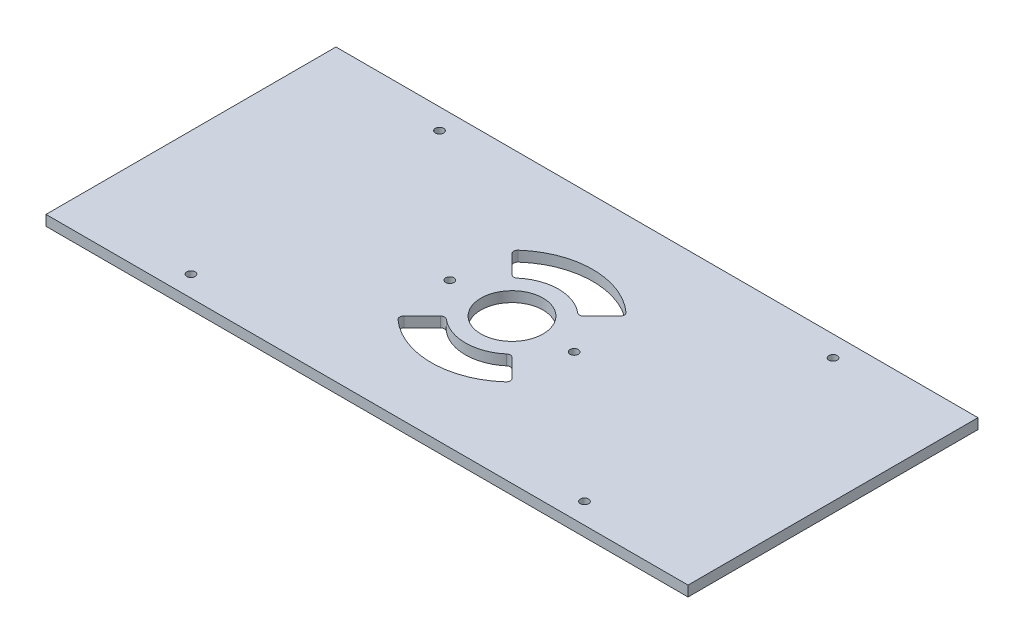
ISO-10303-21;
HEADER;
FILE_DESCRIPTION(('STEP AP214'),'2;1');
FILE_NAME('part.step','',(''),(''),'','','');
FILE_SCHEMA(('AUTOMOTIVE_DESIGN { 1 0 10303 214 1 1 1 1 }'));
ENDSEC;
DATA;
#1=APPLICATION_CONTEXT('core data for automotive mechanical design processes');
#2=APPLICATION_PROTOCOL_DEFINITION('international standard','automotive_design',2000,#1);
#3=PRODUCT_CONTEXT('',#1,'mechanical');
#4=PRODUCT('Part','Part','',(#3));
#5=PRODUCT_RELATED_PRODUCT_CATEGORY('part','',(#4));
#6=PRODUCT_DEFINITION_FORMATION('','',#4);
#7=PRODUCT_DEFINITION_CONTEXT('part definition',#1,'design');
#8=PRODUCT_DEFINITION('design','',#6,#7);
#9=PRODUCT_DEFINITION_SHAPE('','',#8);
#10=(LENGTH_UNIT() NAMED_UNIT(*) SI_UNIT(.MILLI.,.METRE.));
#11=(NAMED_UNIT(*) PLANE_ANGLE_UNIT() SI_UNIT($,.RADIAN.));
#12=(NAMED_UNIT(*) SI_UNIT($,.STERADIAN.) SOLID_ANGLE_UNIT());
#13=UNCERTAINTY_MEASURE_WITH_UNIT(LENGTH_MEASURE(1.E-05),#10,'distance_accuracy_value','');
#14=(GEOMETRIC_REPRESENTATION_CONTEXT(3) GLOBAL_UNCERTAINTY_ASSIGNED_CONTEXT((#13)) GLOBAL_UNIT_ASSIGNED_CONTEXT((#10,
#11,#12)) REPRESENTATION_CONTEXT('',''));
#15=CARTESIAN_POINT('',(0.,0.,0.));
#16=DIRECTION('',(0.,0.,1.));
#17=DIRECTION('',(1.,0.,0.));
#18=AXIS2_PLACEMENT_3D('',#15,#16,#17);
#19=CARTESIAN_POINT('',(0.,5.,0.));
#20=DIRECTION('',(0.,1.,0.));
#21=DIRECTION('',(0.,0.,1.));
#22=AXIS2_PLACEMENT_3D('',#19,#20,#21);
#23=PLANE('',#22);
#24=CARTESIAN_POINT('',(-30.,5.,0.));
#25=DIRECTION('',(0.,1.,0.));
#26=DIRECTION('',(0.,0.,1.));
#27=AXIS2_PLACEMENT_3D('',#24,#25,#26);
#28=CIRCLE('',#27,2.);
#29=CARTESIAN_POINT('',(-30.,5.,2.));
#30=VERTEX_POINT('',#29);
#31=EDGE_CURVE('E545',#30,#30,#28,.T.);
#32=ORIENTED_EDGE('',*,*,#31,.F.);
#33=EDGE_LOOP('',(#32));
#34=FACE_BOUND('',#33,.T.);
#35=CARTESIAN_POINT('',(30.,5.,0.));
#36=DIRECTION('',(0.,1.,0.));
#37=DIRECTION('',(0.,0.,1.));
#38=AXIS2_PLACEMENT_3D('',#35,#36,#37);
#39=CIRCLE('',#38,2.);
#40=CARTESIAN_POINT('',(30.,5.,1.99999999999999));
#41=VERTEX_POINT('',#40);
#42=EDGE_CURVE('E553',#41,#41,#39,.T.);
#43=ORIENTED_EDGE('',*,*,#42,.F.);
#44=EDGE_LOOP('',(#43));
#45=FACE_BOUND('',#44,.T.);
#46=CARTESIAN_POINT('',(-95.,5.,60.));
#47=DIRECTION('',(0.,1.,0.));
#48=DIRECTION('',(0.,0.,-1.));
#49=AXIS2_PLACEMENT_3D('',#46,#47,#48);
#50=CIRCLE('',#49,2.);
#51=CARTESIAN_POINT('',(-95.,5.,58.));
#52=VERTEX_POINT('',#51);
#53=EDGE_CURVE('E574',#52,#52,#50,.T.);
#54=ORIENTED_EDGE('',*,*,#53,.F.);
#55=EDGE_LOOP('',(#54));
#56=FACE_BOUND('',#55,.T.);
#57=CARTESIAN_POINT('',(95.,5.,60.));
#58=DIRECTION('',(0.,1.,0.));
#59=DIRECTION('',(0.,0.,1.));
#60=AXIS2_PLACEMENT_3D('',#57,#58,#59);
#61=CIRCLE('',#60,2.);
#62=CARTESIAN_POINT('',(95.,5.,62.));
#63=VERTEX_POINT('',#62);
#64=EDGE_CURVE('E801',#63,#63,#61,.T.);
#65=ORIENTED_EDGE('',*,*,#64,.F.);
#66=EDGE_LOOP('',(#65));
#67=FACE_BOUND('',#66,.T.);
#68=CARTESIAN_POINT('',(95.,5.,-60.));
#69=DIRECTION('',(0.,1.,0.));
#70=DIRECTION('',(0.,0.,-1.));
#71=AXIS2_PLACEMENT_3D('',#68,#69,#70);
#72=CIRCLE('',#71,2.);
#73=CARTESIAN_POINT('',(95.,5.,-62.));
#74=VERTEX_POINT('',#73);
#75=EDGE_CURVE('E407',#74,#74,#72,.T.);
#76=ORIENTED_EDGE('',*,*,#75,.F.);
#77=EDGE_LOOP('',(#76));
#78=FACE_BOUND('',#77,.T.);
#79=CARTESIAN_POINT('',(-95.,5.,-60.));
#80=DIRECTION('',(0.,1.,0.));
#81=DIRECTION('',(0.,0.,1.));
#82=AXIS2_PLACEMENT_3D('',#79,#80,#81);
#83=CIRCLE('',#82,2.);
#84=CARTESIAN_POINT('',(-95.,5.,-58.));
#85=VERTEX_POINT('',#84);
#86=EDGE_CURVE('E406',#85,#85,#83,.T.);
#87=ORIENTED_EDGE('',*,*,#86,.F.);
#88=EDGE_LOOP('',(#87));
#89=FACE_BOUND('',#88,.T.);
#90=CARTESIAN_POINT('',(0.,5.,0.));
#91=DIRECTION('',(0.,1.,0.));
#92=DIRECTION('',(0.,0.,1.));
#93=AXIS2_PLACEMENT_3D('',#90,#91,#92);
#94=CIRCLE('',#93,15.);
#95=CARTESIAN_POINT('',(0.,5.,15.));
#96=VERTEX_POINT('',#95);
#97=EDGE_CURVE('E432',#96,#96,#94,.T.);
#98=ORIENTED_EDGE('',*,*,#97,.F.);
#99=EDGE_LOOP('',(#98));
#100=FACE_BOUND('',#99,.T.);
#101=DIRECTION('',(0.,0.,-1.));
#102=VECTOR('',#101,1.);
#103=CARTESIAN_POINT('',(155.,5.,-70.));
#104=LINE('',#103,#102);
#105=CARTESIAN_POINT('',(155.,5.,70.));
#106=VERTEX_POINT('',#105);
#107=CARTESIAN_POINT('',(155.,5.,-70.));
#108=VERTEX_POINT('',#107);
#109=EDGE_CURVE('E192',#106,#108,#104,.T.);
#110=ORIENTED_EDGE('',*,*,#109,.T.);
#111=DIRECTION('',(-1.,0.,0.));
#112=VECTOR('',#111,1.);
#113=CARTESIAN_POINT('',(-155.,5.,-70.));
#114=LINE('',#113,#112);
#115=CARTESIAN_POINT('',(-155.,5.,-70.));
#116=VERTEX_POINT('',#115);
#117=EDGE_CURVE('E180',#108,#116,#114,.T.);
#118=ORIENTED_EDGE('',*,*,#117,.T.);
#119=DIRECTION('',(0.,0.,1.));
#120=VECTOR('',#119,1.);
#121=CARTESIAN_POINT('',(-155.,5.,-70.));
#122=LINE('',#121,#120);
#123=CARTESIAN_POINT('',(-155.,5.,70.));
#124=VERTEX_POINT('',#123);
#125=EDGE_CURVE('E191',#116,#124,#122,.T.);
#126=ORIENTED_EDGE('',*,*,#125,.T.);
#127=DIRECTION('',(1.,0.,0.));
#128=VECTOR('',#127,1.);
#129=CARTESIAN_POINT('',(-155.,5.,70.));
#130=LINE('',#129,#128);
#131=EDGE_CURVE('E197',#124,#106,#130,.T.);
#132=ORIENTED_EDGE('',*,*,#131,.T.);
#133=EDGE_LOOP('',(#110,#118,#126,#132));
#134=FACE_BOUND('',#133,.T.);
#135=DIRECTION('',(0.707106781186546,0.,-0.707106781186549));
#136=VECTOR('',#135,1.);
#137=CARTESIAN_POINT('',(0.,5.,0.));
#138=LINE('',#137,#136);
#139=CARTESIAN_POINT('',(17.266296649832,5.,-17.266296649832));
#140=VERTEX_POINT('',#139);
#141=CARTESIAN_POINT('',(26.1247009552262,5.,-26.1247009552263));
#142=VERTEX_POINT('',#141);
#143=EDGE_CURVE('E357',#140,#142,#138,.T.);
#144=ORIENTED_EDGE('',*,*,#143,.F.);
#145=CARTESIAN_POINT('',(15.8520830874589,5.,-18.6805102122051));
#146=DIRECTION('',(0.,1.,0.));
#147=DIRECTION('',(0.,0.,1.));
#148=AXIS2_PLACEMENT_3D('',#145,#146,#147);
#149=CIRCLE('',#148,2.);
#150=CARTESIAN_POINT('',(14.5580354884826,5.,-17.1555706030455));
#151=VERTEX_POINT('',#150);
#152=EDGE_CURVE('E336',#140,#151,#149,.F.);
#153=ORIENTED_EDGE('',*,*,#152,.T.);
#154=CARTESIAN_POINT('',(0.,5.,0.));
#155=DIRECTION('',(0.,1.,0.));
#156=DIRECTION('',(0.,0.,1.));
#157=AXIS2_PLACEMENT_3D('',#154,#155,#156);
#158=CIRCLE('',#157,22.5);
#159=CARTESIAN_POINT('',(-14.5580354884825,5.,-17.1555706030456));
#160=VERTEX_POINT('',#159);
#161=EDGE_CURVE('E375',#151,#160,#158,.T.);
#162=ORIENTED_EDGE('',*,*,#161,.T.);
#163=CARTESIAN_POINT('',(-15.8520830874588,5.,-18.6805102122052));
#164=DIRECTION('',(0.,1.,0.));
#165=DIRECTION('',(0.,0.,1.));
#166=AXIS2_PLACEMENT_3D('',#163,#164,#165);
#167=CIRCLE('',#166,2.);
#168=CARTESIAN_POINT('',(-17.2662966498319,5.,-17.2662966498322));
#169=VERTEX_POINT('',#168);
#170=EDGE_CURVE('E324',#160,#169,#167,.F.);
#171=ORIENTED_EDGE('',*,*,#170,.T.);
#172=DIRECTION('',(-0.707106781186542,0.,-0.707106781186553));
#173=VECTOR('',#172,1.);
#174=CARTESIAN_POINT('',(0.,5.,0.));
#175=LINE('',#174,#173);
#176=CARTESIAN_POINT('',(-26.1247009552261,5.,-26.1247009552265));
#177=VERTEX_POINT('',#176);
#178=EDGE_CURVE('E348',#169,#177,#175,.T.);
#179=ORIENTED_EDGE('',*,*,#178,.T.);
#180=CARTESIAN_POINT('',(-24.7104873928529,5.,-27.5389145175996));
#181=DIRECTION('',(0.,1.,0.));
#182=DIRECTION('',(0.,0.,1.));
#183=AXIS2_PLACEMENT_3D('',#180,#181,#182);
#184=CIRCLE('',#183,2.);
#185=CARTESIAN_POINT('',(-26.0461894140882,5.,-29.0275044915239));
#186=VERTEX_POINT('',#185);
#187=EDGE_CURVE('E50',#177,#186,#184,.F.);
#188=ORIENTED_EDGE('',*,*,#187,.T.);
#189=CARTESIAN_POINT('',(0.,5.,0.));
#190=DIRECTION('',(0.,1.,0.));
#191=DIRECTION('',(0.,0.,1.));
#192=AXIS2_PLACEMENT_3D('',#189,#190,#191);
#193=CIRCLE('',#192,39.);
#194=CARTESIAN_POINT('',(26.0461894140884,5.,-29.0275044915237));
#195=VERTEX_POINT('',#194);
#196=EDGE_CURVE('E346',#195,#186,#193,.T.);
#197=ORIENTED_EDGE('',*,*,#196,.F.);
#198=CARTESIAN_POINT('',(24.7104873928531,5.,-27.5389145175994));
#199=DIRECTION('',(0.,1.,0.));
#200=DIRECTION('',(0.,0.,1.));
#201=AXIS2_PLACEMENT_3D('',#198,#199,#200);
#202=CIRCLE('',#201,2.);
#203=EDGE_CURVE('E330',#195,#142,#202,.F.);
#204=ORIENTED_EDGE('',*,*,#203,.T.);
#205=EDGE_LOOP('',(#144,#153,#162,#171,#179,#188,#197,#204));
#206=FACE_BOUND('',#205,.T.);
#207=DIRECTION('',(-0.707106781186551,0.,0.707106781186544));
#208=VECTOR('',#207,1.);
#209=CARTESIAN_POINT('',(0.,5.,0.));
#210=LINE('',#209,#208);
#211=CARTESIAN_POINT('',(-17.2662966498321,5.,17.2662966498319));
#212=VERTEX_POINT('',#211);
#213=CARTESIAN_POINT('',(-26.1247009552264,5.,26.1247009552261));
#214=VERTEX_POINT('',#213);
#215=EDGE_CURVE('E567',#212,#214,#210,.T.);
#216=ORIENTED_EDGE('',*,*,#215,.F.);
#217=CARTESIAN_POINT('',(-15.852083087459,5.,18.680510212205));
#218=DIRECTION('',(0.,1.,0.));
#219=DIRECTION('',(0.,0.,1.));
#220=AXIS2_PLACEMENT_3D('',#217,#218,#219);
#221=CIRCLE('',#220,2.);
#222=CARTESIAN_POINT('',(-14.5580354884828,5.,17.1555706030454));
#223=VERTEX_POINT('',#222);
#224=EDGE_CURVE('E318',#212,#223,#221,.F.);
#225=ORIENTED_EDGE('',*,*,#224,.T.);
#226=CARTESIAN_POINT('',(0.,5.,0.));
#227=DIRECTION('',(0.,1.,0.));
#228=DIRECTION('',(0.,0.,1.));
#229=AXIS2_PLACEMENT_3D('',#226,#227,#228);
#230=CIRCLE('',#229,22.5);
#231=CARTESIAN_POINT('',(14.5580354884826,5.,17.1555706030455));
#232=VERTEX_POINT('',#231);
#233=EDGE_CURVE('E401',#223,#232,#230,.T.);
#234=ORIENTED_EDGE('',*,*,#233,.T.);
#235=CARTESIAN_POINT('',(15.8520830874589,5.,18.6805102122051));
#236=DIRECTION('',(0.,1.,0.));
#237=DIRECTION('',(0.,0.,1.));
#238=AXIS2_PLACEMENT_3D('',#235,#236,#237);
#239=CIRCLE('',#238,2.);
#240=CARTESIAN_POINT('',(17.266296649832,5.,17.266296649832));
#241=VERTEX_POINT('',#240);
#242=EDGE_CURVE('E300',#232,#241,#239,.F.);
#243=ORIENTED_EDGE('',*,*,#242,.T.);
#244=DIRECTION('',(0.707106781186546,0.,0.707106781186549));
#245=VECTOR('',#244,1.);
#246=CARTESIAN_POINT('',(0.,5.,0.));
#247=LINE('',#246,#245);
#248=CARTESIAN_POINT('',(26.1247009552262,5.,26.1247009552263));
#249=VERTEX_POINT('',#248);
#250=EDGE_CURVE('E570',#241,#249,#247,.T.);
#251=ORIENTED_EDGE('',*,*,#250,.T.);
#252=CARTESIAN_POINT('',(24.7104873928531,5.,27.5389145175994));
#253=DIRECTION('',(0.,1.,0.));
#254=DIRECTION('',(0.,0.,1.));
#255=AXIS2_PLACEMENT_3D('',#252,#253,#254);
#256=CIRCLE('',#255,2.);
#257=CARTESIAN_POINT('',(26.0461894140884,5.,29.0275044915237));
#258=VERTEX_POINT('',#257);
#259=EDGE_CURVE('E306',#249,#258,#256,.F.);
#260=ORIENTED_EDGE('',*,*,#259,.T.);
#261=CARTESIAN_POINT('',(0.,5.,0.));
#262=DIRECTION('',(0.,1.,0.));
#263=DIRECTION('',(0.,0.,1.));
#264=AXIS2_PLACEMENT_3D('',#261,#262,#263);
#265=CIRCLE('',#264,39.);
#266=CARTESIAN_POINT('',(-26.0461894140886,5.,29.0275044915235));
#267=VERTEX_POINT('',#266);
#268=EDGE_CURVE('E575',#267,#258,#265,.T.);
#269=ORIENTED_EDGE('',*,*,#268,.F.);
#270=CARTESIAN_POINT('',(-24.7104873928533,5.,27.5389145175992));
#271=DIRECTION('',(0.,1.,0.));
#272=DIRECTION('',(0.,0.,1.));
#273=AXIS2_PLACEMENT_3D('',#270,#271,#272);
#274=CIRCLE('',#273,2.);
#275=EDGE_CURVE('E312',#267,#214,#274,.F.);
#276=ORIENTED_EDGE('',*,*,#275,.T.);
#277=EDGE_LOOP('',(#216,#225,#234,#243,#251,#260,#269,#276));
#278=FACE_BOUND('',#277,.T.);
#279=ADVANCED_FACE('F41',(#34,#45,#56,#67,#78,#89,#100,#134,#206,#278),#23,.T.);
#280=CARTESIAN_POINT('',(0.,0.,0.));
#281=DIRECTION('',(0.,1.,0.));
#282=DIRECTION('',(0.,0.,1.));
#283=AXIS2_PLACEMENT_3D('',#280,#281,#282);
#284=PLANE('',#283);
#285=CARTESIAN_POINT('',(-30.,0.,0.));
#286=DIRECTION('',(0.,1.,0.));
#287=DIRECTION('',(0.,0.,1.));
#288=AXIS2_PLACEMENT_3D('',#285,#286,#287);
#289=CIRCLE('',#288,2.);
#290=CARTESIAN_POINT('',(-30.,0.,2.));
#291=VERTEX_POINT('',#290);
#292=EDGE_CURVE('E383',#291,#291,#289,.T.);
#293=ORIENTED_EDGE('',*,*,#292,.T.);
#294=EDGE_LOOP('',(#293));
#295=FACE_BOUND('',#294,.T.);
#296=CARTESIAN_POINT('',(30.,0.,0.));
#297=DIRECTION('',(0.,1.,0.));
#298=DIRECTION('',(0.,0.,1.));
#299=AXIS2_PLACEMENT_3D('',#296,#297,#298);
#300=CIRCLE('',#299,2.);
#301=CARTESIAN_POINT('',(30.,0.,1.99999999999999));
#302=VERTEX_POINT('',#301);
#303=EDGE_CURVE('E547',#302,#302,#300,.T.);
#304=ORIENTED_EDGE('',*,*,#303,.T.);
#305=EDGE_LOOP('',(#304));
#306=FACE_BOUND('',#305,.T.);
#307=CARTESIAN_POINT('',(0.,0.,0.));
#308=DIRECTION('',(0.,1.,0.));
#309=DIRECTION('',(0.,0.,1.));
#310=AXIS2_PLACEMENT_3D('',#307,#308,#309);
#311=CIRCLE('',#310,22.5);
#312=CARTESIAN_POINT('',(14.5580354884826,0.,-17.1555706030455));
#313=VERTEX_POINT('',#312);
#314=CARTESIAN_POINT('',(-14.5580354884825,0.,-17.1555706030456));
#315=VERTEX_POINT('',#314);
#316=EDGE_CURVE('E225',#313,#315,#311,.T.);
#317=ORIENTED_EDGE('',*,*,#316,.F.);
#318=CARTESIAN_POINT('',(15.8520830874589,0.,-18.6805102122051));
#319=DIRECTION('',(0.,1.,0.));
#320=DIRECTION('',(0.,0.,1.));
#321=AXIS2_PLACEMENT_3D('',#318,#319,#320);
#322=CIRCLE('',#321,2.);
#323=CARTESIAN_POINT('',(17.266296649832,0.,-17.266296649832));
#324=VERTEX_POINT('',#323);
#325=EDGE_CURVE('E64',#313,#324,#322,.T.);
#326=ORIENTED_EDGE('',*,*,#325,.T.);
#327=DIRECTION('',(0.707106781186546,0.,-0.707106781186549));
#328=VECTOR('',#327,1.);
#329=CARTESIAN_POINT('',(0.,0.,0.));
#330=LINE('',#329,#328);
#331=CARTESIAN_POINT('',(26.1247009552262,0.,-26.1247009552263));
#332=VERTEX_POINT('',#331);
#333=EDGE_CURVE('E208',#324,#332,#330,.T.);
#334=ORIENTED_EDGE('',*,*,#333,.T.);
#335=CARTESIAN_POINT('',(24.7104873928531,0.,-27.5389145175994));
#336=DIRECTION('',(0.,1.,0.));
#337=DIRECTION('',(0.,0.,1.));
#338=AXIS2_PLACEMENT_3D('',#335,#336,#337);
#339=CIRCLE('',#338,2.);
#340=CARTESIAN_POINT('',(26.0461894140884,0.,-29.0275044915237));
#341=VERTEX_POINT('',#340);
#342=EDGE_CURVE('E333',#332,#341,#339,.T.);
#343=ORIENTED_EDGE('',*,*,#342,.T.);
#344=CARTESIAN_POINT('',(0.,0.,0.));
#345=DIRECTION('',(0.,1.,0.));
#346=DIRECTION('',(0.,0.,1.));
#347=AXIS2_PLACEMENT_3D('',#344,#345,#346);
#348=CIRCLE('',#347,39.);
#349=CARTESIAN_POINT('',(-26.0461894140882,0.,-29.0275044915239));
#350=VERTEX_POINT('',#349);
#351=EDGE_CURVE('E212',#341,#350,#348,.T.);
#352=ORIENTED_EDGE('',*,*,#351,.T.);
#353=CARTESIAN_POINT('',(-24.7104873928529,0.,-27.5389145175996));
#354=DIRECTION('',(0.,1.,0.));
#355=DIRECTION('',(0.,0.,1.));
#356=AXIS2_PLACEMENT_3D('',#353,#354,#355);
#357=CIRCLE('',#356,2.);
#358=CARTESIAN_POINT('',(-26.1247009552261,0.,-26.1247009552265));
#359=VERTEX_POINT('',#358);
#360=EDGE_CURVE('E12',#350,#359,#357,.T.);
#361=ORIENTED_EDGE('',*,*,#360,.T.);
#362=DIRECTION('',(-0.707106781186542,0.,-0.707106781186553));
#363=VECTOR('',#362,1.);
#364=CARTESIAN_POINT('',(0.,0.,0.));
#365=LINE('',#364,#363);
#366=CARTESIAN_POINT('',(-17.2662966498319,0.,-17.2662966498322));
#367=VERTEX_POINT('',#366);
#368=EDGE_CURVE('E221',#367,#359,#365,.T.);
#369=ORIENTED_EDGE('',*,*,#368,.F.);
#370=CARTESIAN_POINT('',(-15.8520830874588,0.,-18.6805102122052));
#371=DIRECTION('',(0.,1.,0.));
#372=DIRECTION('',(0.,0.,1.));
#373=AXIS2_PLACEMENT_3D('',#370,#371,#372);
#374=CIRCLE('',#373,2.);
#375=EDGE_CURVE('E327',#367,#315,#374,.T.);
#376=ORIENTED_EDGE('',*,*,#375,.T.);
#377=EDGE_LOOP('',(#317,#326,#334,#343,#352,#361,#369,#376));
#378=FACE_BOUND('',#377,.T.);
#379=CARTESIAN_POINT('',(-95.,0.,60.));
#380=DIRECTION('',(0.,1.,0.));
#381=DIRECTION('',(0.,0.,-1.));
#382=AXIS2_PLACEMENT_3D('',#379,#380,#381);
#383=CIRCLE('',#382,2.);
#384=CARTESIAN_POINT('',(-95.,0.,58.));
#385=VERTEX_POINT('',#384);
#386=EDGE_CURVE('E798',#385,#385,#383,.T.);
#387=ORIENTED_EDGE('',*,*,#386,.T.);
#388=EDGE_LOOP('',(#387));
#389=FACE_BOUND('',#388,.T.);
#390=CARTESIAN_POINT('',(95.,0.,60.));
#391=DIRECTION('',(0.,1.,0.));
#392=DIRECTION('',(0.,0.,1.));
#393=AXIS2_PLACEMENT_3D('',#390,#391,#392);
#394=CIRCLE('',#393,2.);
#395=CARTESIAN_POINT('',(95.,0.,62.));
#396=VERTEX_POINT('',#395);
#397=EDGE_CURVE('E412',#396,#396,#394,.T.);
#398=ORIENTED_EDGE('',*,*,#397,.T.);
#399=EDGE_LOOP('',(#398));
#400=FACE_BOUND('',#399,.T.);
#401=CARTESIAN_POINT('',(95.,0.,-60.));
#402=DIRECTION('',(0.,1.,0.));
#403=DIRECTION('',(0.,0.,-1.));
#404=AXIS2_PLACEMENT_3D('',#401,#402,#403);
#405=CIRCLE('',#404,2.);
#406=CARTESIAN_POINT('',(95.,0.,-62.));
#407=VERTEX_POINT('',#406);
#408=EDGE_CURVE('E402',#407,#407,#405,.T.);
#409=ORIENTED_EDGE('',*,*,#408,.T.);
#410=EDGE_LOOP('',(#409));
#411=FACE_BOUND('',#410,.T.);
#412=CARTESIAN_POINT('',(-95.,0.,-60.));
#413=DIRECTION('',(0.,1.,0.));
#414=DIRECTION('',(0.,0.,1.));
#415=AXIS2_PLACEMENT_3D('',#412,#413,#414);
#416=CIRCLE('',#415,2.);
#417=CARTESIAN_POINT('',(-95.,0.,-58.));
#418=VERTEX_POINT('',#417);
#419=EDGE_CURVE('E427',#418,#418,#416,.T.);
#420=ORIENTED_EDGE('',*,*,#419,.T.);
#421=EDGE_LOOP('',(#420));
#422=FACE_BOUND('',#421,.T.);
#423=CARTESIAN_POINT('',(0.,0.,0.));
#424=DIRECTION('',(0.,1.,0.));
#425=DIRECTION('',(0.,0.,1.));
#426=AXIS2_PLACEMENT_3D('',#423,#424,#425);
#427=CIRCLE('',#426,15.);
#428=CARTESIAN_POINT('',(0.,0.,15.));
#429=VERTEX_POINT('',#428);
#430=EDGE_CURVE('E429',#429,#429,#427,.T.);
#431=ORIENTED_EDGE('',*,*,#430,.T.);
#432=EDGE_LOOP('',(#431));
#433=FACE_BOUND('',#432,.T.);
#434=DIRECTION('',(0.,0.,-1.));
#435=VECTOR('',#434,1.);
#436=CARTESIAN_POINT('',(155.,0.,-70.));
#437=LINE('',#436,#435);
#438=CARTESIAN_POINT('',(155.,0.,70.));
#439=VERTEX_POINT('',#438);
#440=CARTESIAN_POINT('',(155.,0.,-70.));
#441=VERTEX_POINT('',#440);
#442=EDGE_CURVE('E206',#439,#441,#437,.T.);
#443=ORIENTED_EDGE('',*,*,#442,.F.);
#444=DIRECTION('',(1.,0.,0.));
#445=VECTOR('',#444,1.);
#446=CARTESIAN_POINT('',(-155.,0.,70.));
#447=LINE('',#446,#445);
#448=CARTESIAN_POINT('',(-155.,0.,70.));
#449=VERTEX_POINT('',#448);
#450=EDGE_CURVE('E202',#449,#439,#447,.T.);
#451=ORIENTED_EDGE('',*,*,#450,.F.);
#452=DIRECTION('',(0.,0.,1.));
#453=VECTOR('',#452,1.);
#454=CARTESIAN_POINT('',(-155.,0.,-70.));
#455=LINE('',#454,#453);
#456=CARTESIAN_POINT('',(-155.,0.,-70.));
#457=VERTEX_POINT('',#456);
#458=EDGE_CURVE('E451',#457,#449,#455,.T.);
#459=ORIENTED_EDGE('',*,*,#458,.F.);
#460=DIRECTION('',(-1.,0.,0.));
#461=VECTOR('',#460,1.);
#462=CARTESIAN_POINT('',(-155.,0.,-70.));
#463=LINE('',#462,#461);
#464=EDGE_CURVE('E448',#441,#457,#463,.T.);
#465=ORIENTED_EDGE('',*,*,#464,.F.);
#466=EDGE_LOOP('',(#443,#451,#459,#465));
#467=FACE_BOUND('',#466,.T.);
#468=CARTESIAN_POINT('',(0.,0.,0.));
#469=DIRECTION('',(0.,1.,0.));
#470=DIRECTION('',(0.,0.,1.));
#471=AXIS2_PLACEMENT_3D('',#468,#469,#470);
#472=CIRCLE('',#471,22.5);
#473=CARTESIAN_POINT('',(-14.5580354884828,0.,17.1555706030454));
#474=VERTEX_POINT('',#473);
#475=CARTESIAN_POINT('',(14.5580354884826,0.,17.1555706030455));
#476=VERTEX_POINT('',#475);
#477=EDGE_CURVE('E241',#474,#476,#472,.T.);
#478=ORIENTED_EDGE('',*,*,#477,.F.);
#479=CARTESIAN_POINT('',(-15.852083087459,0.,18.680510212205));
#480=DIRECTION('',(0.,1.,0.));
#481=DIRECTION('',(0.,0.,1.));
#482=AXIS2_PLACEMENT_3D('',#479,#480,#481);
#483=CIRCLE('',#482,2.);
#484=CARTESIAN_POINT('',(-17.2662966498321,0.,17.2662966498319));
#485=VERTEX_POINT('',#484);
#486=EDGE_CURVE('E321',#474,#485,#483,.T.);
#487=ORIENTED_EDGE('',*,*,#486,.T.);
#488=DIRECTION('',(-0.707106781186551,0.,0.707106781186544));
#489=VECTOR('',#488,1.);
#490=CARTESIAN_POINT('',(0.,0.,0.));
#491=LINE('',#490,#489);
#492=CARTESIAN_POINT('',(-26.1247009552264,0.,26.1247009552261));
#493=VERTEX_POINT('',#492);
#494=EDGE_CURVE('E229',#485,#493,#491,.T.);
#495=ORIENTED_EDGE('',*,*,#494,.T.);
#496=CARTESIAN_POINT('',(-24.7104873928533,0.,27.5389145175992));
#497=DIRECTION('',(0.,1.,0.));
#498=DIRECTION('',(0.,0.,1.));
#499=AXIS2_PLACEMENT_3D('',#496,#497,#498);
#500=CIRCLE('',#499,2.);
#501=CARTESIAN_POINT('',(-26.0461894140886,0.,29.0275044915235));
#502=VERTEX_POINT('',#501);
#503=EDGE_CURVE('E315',#493,#502,#500,.T.);
#504=ORIENTED_EDGE('',*,*,#503,.T.);
#505=CARTESIAN_POINT('',(0.,0.,0.));
#506=DIRECTION('',(0.,1.,0.));
#507=DIRECTION('',(0.,0.,1.));
#508=AXIS2_PLACEMENT_3D('',#505,#506,#507);
#509=CIRCLE('',#508,39.);
#510=CARTESIAN_POINT('',(26.0461894140884,0.,29.0275044915237));
#511=VERTEX_POINT('',#510);
#512=EDGE_CURVE('E233',#502,#511,#509,.T.);
#513=ORIENTED_EDGE('',*,*,#512,.T.);
#514=CARTESIAN_POINT('',(24.7104873928531,0.,27.5389145175994));
#515=DIRECTION('',(0.,1.,0.));
#516=DIRECTION('',(0.,0.,1.));
#517=AXIS2_PLACEMENT_3D('',#514,#515,#516);
#518=CIRCLE('',#517,2.);
#519=CARTESIAN_POINT('',(26.1247009552262,0.,26.1247009552263));
#520=VERTEX_POINT('',#519);
#521=EDGE_CURVE('E309',#511,#520,#518,.T.);
#522=ORIENTED_EDGE('',*,*,#521,.T.);
#523=DIRECTION('',(0.707106781186546,0.,0.707106781186549));
#524=VECTOR('',#523,1.);
#525=CARTESIAN_POINT('',(0.,0.,0.));
#526=LINE('',#525,#524);
#527=CARTESIAN_POINT('',(17.266296649832,0.,17.266296649832));
#528=VERTEX_POINT('',#527);
#529=EDGE_CURVE('E237',#528,#520,#526,.T.);
#530=ORIENTED_EDGE('',*,*,#529,.F.);
#531=CARTESIAN_POINT('',(15.8520830874589,0.,18.6805102122051));
#532=DIRECTION('',(0.,1.,0.));
#533=DIRECTION('',(0.,0.,1.));
#534=AXIS2_PLACEMENT_3D('',#531,#532,#533);
#535=CIRCLE('',#534,2.);
#536=EDGE_CURVE('E303',#528,#476,#535,.T.);
#537=ORIENTED_EDGE('',*,*,#536,.T.);
#538=EDGE_LOOP('',(#478,#487,#495,#504,#513,#522,#530,#537));
#539=FACE_BOUND('',#538,.T.);
#540=ADVANCED_FACE('F361',(#295,#306,#378,#389,#400,#411,#422,#433,#467,#539),#284,.F.);
#541=CARTESIAN_POINT('',(155.,5.,-70.));
#542=DIRECTION('',(-1.,0.,0.));
#543=DIRECTION('',(0.,0.,1.));
#544=AXIS2_PLACEMENT_3D('',#541,#542,#543);
#545=PLANE('',#544);
#546=ORIENTED_EDGE('',*,*,#442,.T.);
#547=DIRECTION('',(0.,-1.,0.));
#548=VECTOR('',#547,1.);
#549=CARTESIAN_POINT('',(155.,5.,-70.));
#550=LINE('',#549,#548);
#551=EDGE_CURVE('E184',#108,#441,#550,.T.);
#552=ORIENTED_EDGE('',*,*,#551,.F.);
#553=ORIENTED_EDGE('',*,*,#109,.F.);
#554=DIRECTION('',(0.,-1.,0.));
#555=VECTOR('',#554,1.);
#556=CARTESIAN_POINT('',(155.,5.,70.));
#557=LINE('',#556,#555);
#558=EDGE_CURVE('E445',#106,#439,#557,.T.);
#559=ORIENTED_EDGE('',*,*,#558,.T.);
#560=EDGE_LOOP('',(#546,#552,#553,#559));
#561=FACE_BOUND('',#560,.T.);
#562=ADVANCED_FACE('F204',(#561),#545,.F.);
#563=CARTESIAN_POINT('',(-155.,5.,-70.));
#564=DIRECTION('',(0.,0.,1.));
#565=DIRECTION('',(1.,0.,0.));
#566=AXIS2_PLACEMENT_3D('',#563,#564,#565);
#567=PLANE('',#566);
#568=ORIENTED_EDGE('',*,*,#464,.T.);
#569=DIRECTION('',(0.,-1.,0.));
#570=VECTOR('',#569,1.);
#571=CARTESIAN_POINT('',(-155.,5.,-70.));
#572=LINE('',#571,#570);
#573=EDGE_CURVE('E187',#116,#457,#572,.T.);
#574=ORIENTED_EDGE('',*,*,#573,.F.);
#575=ORIENTED_EDGE('',*,*,#117,.F.);
#576=ORIENTED_EDGE('',*,*,#551,.T.);
#577=EDGE_LOOP('',(#568,#574,#575,#576));
#578=FACE_BOUND('',#577,.T.);
#579=ADVANCED_FACE('F182',(#578),#567,.F.);
#580=CARTESIAN_POINT('',(-155.,5.,-70.));
#581=DIRECTION('',(1.,0.,0.));
#582=DIRECTION('',(0.,0.,-1.));
#583=AXIS2_PLACEMENT_3D('',#580,#581,#582);
#584=PLANE('',#583);
#585=ORIENTED_EDGE('',*,*,#458,.T.);
#586=DIRECTION('',(0.,-1.,0.));
#587=VECTOR('',#586,1.);
#588=CARTESIAN_POINT('',(-155.,5.,70.));
#589=LINE('',#588,#587);
#590=EDGE_CURVE('E214',#124,#449,#589,.T.);
#591=ORIENTED_EDGE('',*,*,#590,.F.);
#592=ORIENTED_EDGE('',*,*,#125,.F.);
#593=ORIENTED_EDGE('',*,*,#573,.T.);
#594=EDGE_LOOP('',(#585,#591,#592,#593));
#595=FACE_BOUND('',#594,.T.);
#596=ADVANCED_FACE('F467',(#595),#584,.F.);
#597=CARTESIAN_POINT('',(-155.,5.,70.));
#598=DIRECTION('',(0.,0.,-1.));
#599=DIRECTION('',(-1.,0.,0.));
#600=AXIS2_PLACEMENT_3D('',#597,#598,#599);
#601=PLANE('',#600);
#602=ORIENTED_EDGE('',*,*,#450,.T.);
#603=ORIENTED_EDGE('',*,*,#558,.F.);
#604=ORIENTED_EDGE('',*,*,#131,.F.);
#605=ORIENTED_EDGE('',*,*,#590,.T.);
#606=EDGE_LOOP('',(#602,#603,#604,#605));
#607=FACE_BOUND('',#606,.T.);
#608=ADVANCED_FACE('F462',(#607),#601,.F.);
#609=CARTESIAN_POINT('',(0.,0.,0.));
#610=DIRECTION('',(0.,1.,0.));
#611=DIRECTION('',(0.,0.,1.));
#612=AXIS2_PLACEMENT_3D('',#609,#610,#611);
#613=CYLINDRICAL_SURFACE('',#612,15.);
#614=ORIENTED_EDGE('',*,*,#430,.F.);
#615=EDGE_LOOP('',(#614));
#616=FACE_BOUND('',#615,.T.);
#617=ORIENTED_EDGE('',*,*,#97,.T.);
#618=EDGE_LOOP('',(#617));
#619=FACE_BOUND('',#618,.T.);
#620=ADVANCED_FACE('F474',(#616,#619),#613,.F.);
#621=CARTESIAN_POINT('',(-95.,0.,-60.));
#622=DIRECTION('',(0.,1.,0.));
#623=DIRECTION('',(0.,0.,1.));
#624=AXIS2_PLACEMENT_3D('',#621,#622,#623);
#625=CYLINDRICAL_SURFACE('',#624,2.);
#626=ORIENTED_EDGE('',*,*,#419,.F.);
#627=EDGE_LOOP('',(#626));
#628=FACE_BOUND('',#627,.T.);
#629=ORIENTED_EDGE('',*,*,#86,.T.);
#630=EDGE_LOOP('',(#629));
#631=FACE_BOUND('',#630,.T.);
#632=ADVANCED_FACE('F490',(#628,#631),#625,.F.);
#633=CARTESIAN_POINT('',(95.,0.,-60.));
#634=DIRECTION('',(0.,1.,0.));
#635=DIRECTION('',(0.,0.,1.));
#636=AXIS2_PLACEMENT_3D('',#633,#634,#635);
#637=CYLINDRICAL_SURFACE('',#636,2.);
#638=ORIENTED_EDGE('',*,*,#408,.F.);
#639=EDGE_LOOP('',(#638));
#640=FACE_BOUND('',#639,.T.);
#641=ORIENTED_EDGE('',*,*,#75,.T.);
#642=EDGE_LOOP('',(#641));
#643=FACE_BOUND('',#642,.T.);
#644=ADVANCED_FACE('F494',(#640,#643),#637,.F.);
#645=CARTESIAN_POINT('',(95.,0.,60.));
#646=DIRECTION('',(0.,1.,0.));
#647=DIRECTION('',(0.,0.,1.));
#648=AXIS2_PLACEMENT_3D('',#645,#646,#647);
#649=CYLINDRICAL_SURFACE('',#648,2.);
#650=ORIENTED_EDGE('',*,*,#397,.F.);
#651=EDGE_LOOP('',(#650));
#652=FACE_BOUND('',#651,.T.);
#653=ORIENTED_EDGE('',*,*,#64,.T.);
#654=EDGE_LOOP('',(#653));
#655=FACE_BOUND('',#654,.T.);
#656=ADVANCED_FACE('F499',(#652,#655),#649,.F.);
#657=CARTESIAN_POINT('',(-95.,0.,60.));
#658=DIRECTION('',(0.,1.,0.));
#659=DIRECTION('',(0.,0.,1.));
#660=AXIS2_PLACEMENT_3D('',#657,#658,#659);
#661=CYLINDRICAL_SURFACE('',#660,2.);
#662=ORIENTED_EDGE('',*,*,#386,.F.);
#663=EDGE_LOOP('',(#662));
#664=FACE_BOUND('',#663,.T.);
#665=ORIENTED_EDGE('',*,*,#53,.T.);
#666=EDGE_LOOP('',(#665));
#667=FACE_BOUND('',#666,.T.);
#668=ADVANCED_FACE('F496',(#664,#667),#661,.F.);
#669=CARTESIAN_POINT('',(0.,-5.,0.));
#670=DIRECTION('',(0.,1.,0.));
#671=DIRECTION('',(0.,0.,1.));
#672=AXIS2_PLACEMENT_3D('',#669,#670,#671);
#673=CYLINDRICAL_SURFACE('',#672,22.5);
#674=ORIENTED_EDGE('',*,*,#316,.T.);
#675=DIRECTION('',(0.,1.,0.));
#676=VECTOR('',#675,1.);
#677=CARTESIAN_POINT('',(-14.5580354884825,-5.,-17.1555706030456));
#678=LINE('',#677,#676);
#679=EDGE_CURVE('E276',#315,#160,#678,.T.);
#680=ORIENTED_EDGE('',*,*,#679,.T.);
#681=ORIENTED_EDGE('',*,*,#161,.F.);
#682=DIRECTION('',(0.,1.,0.));
#683=VECTOR('',#682,1.);
#684=CARTESIAN_POINT('',(14.5580354884826,-5.,-17.1555706030455));
#685=LINE('',#684,#683);
#686=EDGE_CURVE('E273',#151,#313,#685,.F.);
#687=ORIENTED_EDGE('',*,*,#686,.T.);
#688=EDGE_LOOP('',(#674,#680,#681,#687));
#689=FACE_BOUND('',#688,.T.);
#690=ADVANCED_FACE('F371',(#689),#673,.T.);
#691=CARTESIAN_POINT('',(0.,-5.,0.));
#692=DIRECTION('',(0.707106781186553,0.,-0.707106781186542));
#693=DIRECTION('',(-0.707106781186542,0.,-0.707106781186553));
#694=AXIS2_PLACEMENT_3D('',#691,#692,#693);
#695=PLANE('',#694);
#696=ORIENTED_EDGE('',*,*,#178,.F.);
#697=DIRECTION('',(0.,-1.,0.));
#698=VECTOR('',#697,1.);
#699=CARTESIAN_POINT('',(-17.2662966498319,0.,-17.2662966498322));
#700=LINE('',#699,#698);
#701=EDGE_CURVE('E284',#169,#367,#700,.T.);
#702=ORIENTED_EDGE('',*,*,#701,.T.);
#703=ORIENTED_EDGE('',*,*,#368,.T.);
#704=DIRECTION('',(0.,1.,0.));
#705=VECTOR('',#704,1.);
#706=CARTESIAN_POINT('',(-26.124700955226,-5.,-26.1247009552265));
#707=LINE('',#706,#705);
#708=EDGE_CURVE('E280',#359,#177,#707,.T.);
#709=ORIENTED_EDGE('',*,*,#708,.T.);
#710=EDGE_LOOP('',(#696,#702,#703,#709));
#711=FACE_BOUND('',#710,.T.);
#712=ADVANCED_FACE('F365',(#711),#695,.T.);
#713=CARTESIAN_POINT('',(0.,-5.,0.));
#714=DIRECTION('',(0.,1.,0.));
#715=DIRECTION('',(0.,0.,1.));
#716=AXIS2_PLACEMENT_3D('',#713,#714,#715);
#717=CYLINDRICAL_SURFACE('',#716,39.);
#718=ORIENTED_EDGE('',*,*,#351,.F.);
#719=DIRECTION('',(0.,1.,0.));
#720=VECTOR('',#719,1.);
#721=CARTESIAN_POINT('',(26.0461894140884,-5.,-29.0275044915237));
#722=LINE('',#721,#720);
#723=EDGE_CURVE('E290',#341,#195,#722,.T.);
#724=ORIENTED_EDGE('',*,*,#723,.T.);
#725=ORIENTED_EDGE('',*,*,#196,.T.);
#726=DIRECTION('',(0.,1.,0.));
#727=VECTOR('',#726,1.);
#728=CARTESIAN_POINT('',(-26.0461894140882,-5.,-29.0275044915239));
#729=LINE('',#728,#727);
#730=EDGE_CURVE('E287',#186,#350,#729,.F.);
#731=ORIENTED_EDGE('',*,*,#730,.T.);
#732=EDGE_LOOP('',(#718,#724,#725,#731));
#733=FACE_BOUND('',#732,.T.);
#734=ADVANCED_FACE('F354',(#733),#717,.F.);
#735=CARTESIAN_POINT('',(0.,-5.,0.));
#736=DIRECTION('',(0.707106781186549,0.,0.707106781186546));
#737=DIRECTION('',(0.707106781186546,0.,-0.707106781186549));
#738=AXIS2_PLACEMENT_3D('',#735,#736,#737);
#739=PLANE('',#738);
#740=ORIENTED_EDGE('',*,*,#143,.T.);
#741=DIRECTION('',(0.,-1.,0.));
#742=VECTOR('',#741,1.);
#743=CARTESIAN_POINT('',(26.1247009552262,0.,-26.1247009552263));
#744=LINE('',#743,#742);
#745=EDGE_CURVE('E57',#142,#332,#744,.T.);
#746=ORIENTED_EDGE('',*,*,#745,.T.);
#747=ORIENTED_EDGE('',*,*,#333,.F.);
#748=DIRECTION('',(0.,1.,0.));
#749=VECTOR('',#748,1.);
#750=CARTESIAN_POINT('',(17.266296649832,-5.,-17.266296649832));
#751=LINE('',#750,#749);
#752=EDGE_CURVE('E294',#324,#140,#751,.T.);
#753=ORIENTED_EDGE('',*,*,#752,.T.);
#754=EDGE_LOOP('',(#740,#746,#747,#753));
#755=FACE_BOUND('',#754,.T.);
#756=ADVANCED_FACE('F379',(#755),#739,.F.);
#757=CARTESIAN_POINT('',(0.,-5.,0.));
#758=DIRECTION('',(0.,1.,0.));
#759=DIRECTION('',(0.,0.,1.));
#760=AXIS2_PLACEMENT_3D('',#757,#758,#759);
#761=CYLINDRICAL_SURFACE('',#760,22.5);
#762=ORIENTED_EDGE('',*,*,#477,.T.);
#763=DIRECTION('',(0.,1.,0.));
#764=VECTOR('',#763,1.);
#765=CARTESIAN_POINT('',(14.5580354884827,-5.,17.1555706030455));
#766=LINE('',#765,#764);
#767=EDGE_CURVE('E248',#476,#232,#766,.T.);
#768=ORIENTED_EDGE('',*,*,#767,.T.);
#769=ORIENTED_EDGE('',*,*,#233,.F.);
#770=DIRECTION('',(0.,1.,0.));
#771=VECTOR('',#770,1.);
#772=CARTESIAN_POINT('',(-14.5580354884828,-5.,17.1555706030454));
#773=LINE('',#772,#771);
#774=EDGE_CURVE('E245',#223,#474,#773,.F.);
#775=ORIENTED_EDGE('',*,*,#774,.T.);
#776=EDGE_LOOP('',(#762,#768,#769,#775));
#777=FACE_BOUND('',#776,.T.);
#778=ADVANCED_FACE('F511',(#777),#761,.T.);
#779=CARTESIAN_POINT('',(0.,-5.,0.));
#780=DIRECTION('',(-0.707106781186549,0.,0.707106781186546));
#781=DIRECTION('',(0.707106781186546,0.,0.707106781186549));
#782=AXIS2_PLACEMENT_3D('',#779,#780,#781);
#783=PLANE('',#782);
#784=ORIENTED_EDGE('',*,*,#250,.F.);
#785=DIRECTION('',(0.,-1.,0.));
#786=VECTOR('',#785,1.);
#787=CARTESIAN_POINT('',(17.266296649832,0.,17.266296649832));
#788=LINE('',#787,#786);
#789=EDGE_CURVE('E256',#241,#528,#788,.T.);
#790=ORIENTED_EDGE('',*,*,#789,.T.);
#791=ORIENTED_EDGE('',*,*,#529,.T.);
#792=DIRECTION('',(0.,1.,0.));
#793=VECTOR('',#792,1.);
#794=CARTESIAN_POINT('',(26.1247009552262,-5.,26.1247009552263));
#795=LINE('',#794,#793);
#796=EDGE_CURVE('E252',#520,#249,#795,.T.);
#797=ORIENTED_EDGE('',*,*,#796,.T.);
#798=EDGE_LOOP('',(#784,#790,#791,#797));
#799=FACE_BOUND('',#798,.T.);
#800=ADVANCED_FACE('F518',(#799),#783,.T.);
#801=CARTESIAN_POINT('',(0.,-5.,0.));
#802=DIRECTION('',(0.,1.,0.));
#803=DIRECTION('',(0.,0.,1.));
#804=AXIS2_PLACEMENT_3D('',#801,#802,#803);
#805=CYLINDRICAL_SURFACE('',#804,39.);
#806=ORIENTED_EDGE('',*,*,#268,.T.);
#807=DIRECTION('',(0.,1.,0.));
#808=VECTOR('',#807,1.);
#809=CARTESIAN_POINT('',(26.0461894140884,-5.,29.0275044915237));
#810=LINE('',#809,#808);
#811=EDGE_CURVE('E263',#258,#511,#810,.F.);
#812=ORIENTED_EDGE('',*,*,#811,.T.);
#813=ORIENTED_EDGE('',*,*,#512,.F.);
#814=DIRECTION('',(0.,1.,0.));
#815=VECTOR('',#814,1.);
#816=CARTESIAN_POINT('',(-26.0461894140886,-5.,29.0275044915235));
#817=LINE('',#816,#815);
#818=EDGE_CURVE('E259',#502,#267,#817,.T.);
#819=ORIENTED_EDGE('',*,*,#818,.T.);
#820=EDGE_LOOP('',(#806,#812,#813,#819));
#821=FACE_BOUND('',#820,.T.);
#822=ADVANCED_FACE('F524',(#821),#805,.F.);
#823=CARTESIAN_POINT('',(0.,-5.,0.));
#824=DIRECTION('',(-0.707106781186544,0.,-0.707106781186551));
#825=DIRECTION('',(-0.707106781186551,0.,0.707106781186544));
#826=AXIS2_PLACEMENT_3D('',#823,#824,#825);
#827=PLANE('',#826);
#828=ORIENTED_EDGE('',*,*,#215,.T.);
#829=DIRECTION('',(0.,-1.,0.));
#830=VECTOR('',#829,1.);
#831=CARTESIAN_POINT('',(-26.1247009552264,0.,26.1247009552261));
#832=LINE('',#831,#830);
#833=EDGE_CURVE('E270',#214,#493,#832,.T.);
#834=ORIENTED_EDGE('',*,*,#833,.T.);
#835=ORIENTED_EDGE('',*,*,#494,.F.);
#836=DIRECTION('',(0.,1.,0.));
#837=VECTOR('',#836,1.);
#838=CARTESIAN_POINT('',(-17.2662966498321,-5.,17.2662966498319));
#839=LINE('',#838,#837);
#840=EDGE_CURVE('E266',#485,#212,#839,.T.);
#841=ORIENTED_EDGE('',*,*,#840,.T.);
#842=EDGE_LOOP('',(#828,#834,#835,#841));
#843=FACE_BOUND('',#842,.T.);
#844=ADVANCED_FACE('F520',(#843),#827,.F.);
#845=CARTESIAN_POINT('',(15.8520830874589,-5.,18.6805102122051));
#846=DIRECTION('',(0.,1.,0.));
#847=DIRECTION('',(0.,0.,1.));
#848=AXIS2_PLACEMENT_3D('',#845,#846,#847);
#849=CYLINDRICAL_SURFACE('',#848,2.);
#850=ORIENTED_EDGE('',*,*,#536,.F.);
#851=ORIENTED_EDGE('',*,*,#789,.F.);
#852=ORIENTED_EDGE('',*,*,#242,.F.);
#853=ORIENTED_EDGE('',*,*,#767,.F.);
#854=EDGE_LOOP('',(#850,#851,#852,#853));
#855=FACE_BOUND('',#854,.T.);
#856=ADVANCED_FACE('F523',(#855),#849,.F.);
#857=CARTESIAN_POINT('',(24.7104873928531,-5.,27.5389145175994));
#858=DIRECTION('',(0.,1.,0.));
#859=DIRECTION('',(0.,0.,1.));
#860=AXIS2_PLACEMENT_3D('',#857,#858,#859);
#861=CYLINDRICAL_SURFACE('',#860,2.);
#862=ORIENTED_EDGE('',*,*,#521,.F.);
#863=ORIENTED_EDGE('',*,*,#811,.F.);
#864=ORIENTED_EDGE('',*,*,#259,.F.);
#865=ORIENTED_EDGE('',*,*,#796,.F.);
#866=EDGE_LOOP('',(#862,#863,#864,#865));
#867=FACE_BOUND('',#866,.T.);
#868=ADVANCED_FACE('F595',(#867),#861,.F.);
#869=CARTESIAN_POINT('',(-24.7104873928533,-5.,27.5389145175992));
#870=DIRECTION('',(0.,1.,0.));
#871=DIRECTION('',(0.,0.,1.));
#872=AXIS2_PLACEMENT_3D('',#869,#870,#871);
#873=CYLINDRICAL_SURFACE('',#872,2.);
#874=ORIENTED_EDGE('',*,*,#503,.F.);
#875=ORIENTED_EDGE('',*,*,#833,.F.);
#876=ORIENTED_EDGE('',*,*,#275,.F.);
#877=ORIENTED_EDGE('',*,*,#818,.F.);
#878=EDGE_LOOP('',(#874,#875,#876,#877));
#879=FACE_BOUND('',#878,.T.);
#880=ADVANCED_FACE('F589',(#879),#873,.F.);
#881=CARTESIAN_POINT('',(-15.852083087459,-5.,18.680510212205));
#882=DIRECTION('',(0.,1.,0.));
#883=DIRECTION('',(0.,0.,1.));
#884=AXIS2_PLACEMENT_3D('',#881,#882,#883);
#885=CYLINDRICAL_SURFACE('',#884,2.);
#886=ORIENTED_EDGE('',*,*,#486,.F.);
#887=ORIENTED_EDGE('',*,*,#774,.F.);
#888=ORIENTED_EDGE('',*,*,#224,.F.);
#889=ORIENTED_EDGE('',*,*,#840,.F.);
#890=EDGE_LOOP('',(#886,#887,#888,#889));
#891=FACE_BOUND('',#890,.T.);
#892=ADVANCED_FACE('F607',(#891),#885,.F.);
#893=CARTESIAN_POINT('',(-15.8520830874588,-5.,-18.6805102122052));
#894=DIRECTION('',(0.,1.,0.));
#895=DIRECTION('',(0.,0.,1.));
#896=AXIS2_PLACEMENT_3D('',#893,#894,#895);
#897=CYLINDRICAL_SURFACE('',#896,2.);
#898=ORIENTED_EDGE('',*,*,#375,.F.);
#899=ORIENTED_EDGE('',*,*,#701,.F.);
#900=ORIENTED_EDGE('',*,*,#170,.F.);
#901=ORIENTED_EDGE('',*,*,#679,.F.);
#902=EDGE_LOOP('',(#898,#899,#900,#901));
#903=FACE_BOUND('',#902,.T.);
#904=ADVANCED_FACE('F368',(#903),#897,.F.);
#905=CARTESIAN_POINT('',(24.7104873928531,-5.,-27.5389145175994));
#906=DIRECTION('',(0.,1.,0.));
#907=DIRECTION('',(0.,0.,1.));
#908=AXIS2_PLACEMENT_3D('',#905,#906,#907);
#909=CYLINDRICAL_SURFACE('',#908,2.);
#910=ORIENTED_EDGE('',*,*,#342,.F.);
#911=ORIENTED_EDGE('',*,*,#745,.F.);
#912=ORIENTED_EDGE('',*,*,#203,.F.);
#913=ORIENTED_EDGE('',*,*,#723,.F.);
#914=EDGE_LOOP('',(#910,#911,#912,#913));
#915=FACE_BOUND('',#914,.T.);
#916=ADVANCED_FACE('F614',(#915),#909,.F.);
#917=CARTESIAN_POINT('',(15.8520830874589,-5.,-18.6805102122051));
#918=DIRECTION('',(0.,1.,0.));
#919=DIRECTION('',(0.,0.,1.));
#920=AXIS2_PLACEMENT_3D('',#917,#918,#919);
#921=CYLINDRICAL_SURFACE('',#920,2.);
#922=ORIENTED_EDGE('',*,*,#325,.F.);
#923=ORIENTED_EDGE('',*,*,#686,.F.);
#924=ORIENTED_EDGE('',*,*,#152,.F.);
#925=ORIENTED_EDGE('',*,*,#752,.F.);
#926=EDGE_LOOP('',(#922,#923,#924,#925));
#927=FACE_BOUND('',#926,.T.);
#928=ADVANCED_FACE('F377',(#927),#921,.F.);
#929=CARTESIAN_POINT('',(-24.7104873928529,-5.,-27.5389145175996));
#930=DIRECTION('',(0.,1.,0.));
#931=DIRECTION('',(0.,0.,1.));
#932=AXIS2_PLACEMENT_3D('',#929,#930,#931);
#933=CYLINDRICAL_SURFACE('',#932,2.);
#934=ORIENTED_EDGE('',*,*,#360,.F.);
#935=ORIENTED_EDGE('',*,*,#730,.F.);
#936=ORIENTED_EDGE('',*,*,#187,.F.);
#937=ORIENTED_EDGE('',*,*,#708,.F.);
#938=EDGE_LOOP('',(#934,#935,#936,#937));
#939=FACE_BOUND('',#938,.T.);
#940=ADVANCED_FACE('F43',(#939),#933,.F.);
#941=CARTESIAN_POINT('',(30.,0.,0.));
#942=DIRECTION('',(0.,1.,0.));
#943=DIRECTION('',(0.,0.,1.));
#944=AXIS2_PLACEMENT_3D('',#941,#942,#943);
#945=CYLINDRICAL_SURFACE('',#944,2.);
#946=ORIENTED_EDGE('',*,*,#303,.F.);
#947=EDGE_LOOP('',(#946));
#948=FACE_BOUND('',#947,.T.);
#949=ORIENTED_EDGE('',*,*,#42,.T.);
#950=EDGE_LOOP('',(#949));
#951=FACE_BOUND('',#950,.T.);
#952=ADVANCED_FACE('F532',(#948,#951),#945,.F.);
#953=CARTESIAN_POINT('',(-30.,0.,0.));
#954=DIRECTION('',(0.,1.,0.));
#955=DIRECTION('',(0.,0.,1.));
#956=AXIS2_PLACEMENT_3D('',#953,#954,#955);
#957=CYLINDRICAL_SURFACE('',#956,2.);
#958=ORIENTED_EDGE('',*,*,#292,.F.);
#959=EDGE_LOOP('',(#958));
#960=FACE_BOUND('',#959,.T.);
#961=ORIENTED_EDGE('',*,*,#31,.T.);
#962=EDGE_LOOP('',(#961));
#963=FACE_BOUND('',#962,.T.);
#964=ADVANCED_FACE('F535',(#960,#963),#957,.F.);
#965=CLOSED_SHELL('',(#279,#540,#562,#579,#596,#608,#620,#632,#644,#656,#668,#690,#712,#734,
#756,#778,#800,#822,#844,#856,#868,#880,#892,#904,#916,#928,#940,#952,#964));
#966=MANIFOLD_SOLID_BREP('B2',#965);
#967=ADVANCED_BREP_SHAPE_REPRESENTATION('',(#18,#966),#14);
#968=SHAPE_DEFINITION_REPRESENTATION(#9,#967);
ENDSEC;
END-ISO-10303-21;
